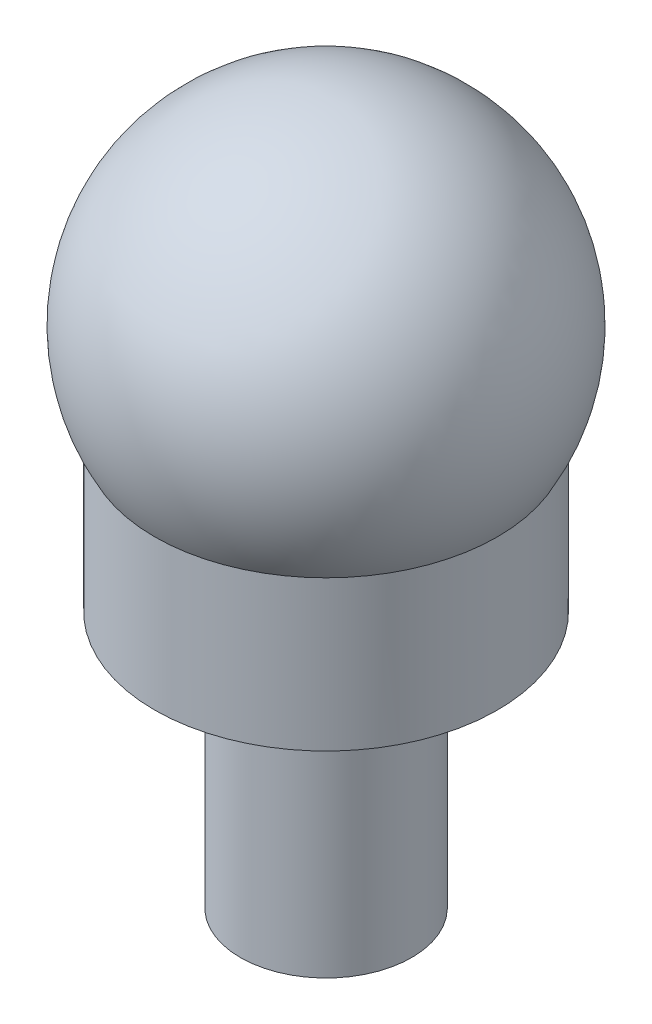
ISO-10303-21;
HEADER;
FILE_DESCRIPTION(('STEP AP214'),'2;1');
FILE_NAME('part.step','',(''),(''),'','','');
FILE_SCHEMA(('AUTOMOTIVE_DESIGN { 1 0 10303 214 1 1 1 1 }'));
ENDSEC;
DATA;
#1=APPLICATION_CONTEXT('core data for automotive mechanical design processes');
#2=APPLICATION_PROTOCOL_DEFINITION('international standard','automotive_design',2000,#1);
#3=PRODUCT_CONTEXT('',#1,'mechanical');
#4=PRODUCT('Part','Part','',(#3));
#5=PRODUCT_RELATED_PRODUCT_CATEGORY('part','',(#4));
#6=PRODUCT_DEFINITION_FORMATION('','',#4);
#7=PRODUCT_DEFINITION_CONTEXT('part definition',#1,'design');
#8=PRODUCT_DEFINITION('design','',#6,#7);
#9=PRODUCT_DEFINITION_SHAPE('','',#8);
#10=(LENGTH_UNIT() NAMED_UNIT(*) SI_UNIT(.MILLI.,.METRE.));
#11=(NAMED_UNIT(*) PLANE_ANGLE_UNIT() SI_UNIT($,.RADIAN.));
#12=(NAMED_UNIT(*) SI_UNIT($,.STERADIAN.) SOLID_ANGLE_UNIT());
#13=UNCERTAINTY_MEASURE_WITH_UNIT(LENGTH_MEASURE(1.E-05),#10,'distance_accuracy_value','');
#14=(GEOMETRIC_REPRESENTATION_CONTEXT(3) GLOBAL_UNCERTAINTY_ASSIGNED_CONTEXT((#13)) GLOBAL_UNIT_ASSIGNED_CONTEXT((#10,
#11,#12)) REPRESENTATION_CONTEXT('',''));
#15=CARTESIAN_POINT('',(0.,0.,0.));
#16=DIRECTION('',(0.,0.,1.));
#17=DIRECTION('',(1.,0.,0.));
#18=AXIS2_PLACEMENT_3D('',#15,#16,#17);
#19=CARTESIAN_POINT('',(0.,12.,0.));
#20=DIRECTION('',(0.,-1.,0.));
#21=DIRECTION('',(0.,0.,-1.));
#22=AXIS2_PLACEMENT_3D('',#19,#20,#21);
#23=CYLINDRICAL_SURFACE('',#22,4.);
#24=CARTESIAN_POINT('',(0.,12.,0.));
#25=DIRECTION('',(0.,1.,0.));
#26=DIRECTION('',(0.,0.,1.));
#27=AXIS2_PLACEMENT_3D('',#24,#25,#26);
#28=CIRCLE('',#27,4.);
#29=CARTESIAN_POINT('',(0.,12.,4.));
#30=VERTEX_POINT('',#29);
#31=EDGE_CURVE('E10',#30,#30,#28,.T.);
#32=ORIENTED_EDGE('',*,*,#31,.F.);
#33=EDGE_LOOP('',(#32));
#34=FACE_BOUND('',#33,.T.);
#35=CARTESIAN_POINT('',(0.,0.,0.));
#36=DIRECTION('',(0.,1.,0.));
#37=DIRECTION('',(0.,0.,1.));
#38=AXIS2_PLACEMENT_3D('',#35,#36,#37);
#39=CIRCLE('',#38,4.);
#40=CARTESIAN_POINT('',(0.,0.,4.));
#41=VERTEX_POINT('',#40);
#42=EDGE_CURVE('E36',#41,#41,#39,.T.);
#43=ORIENTED_EDGE('',*,*,#42,.T.);
#44=EDGE_LOOP('',(#43));
#45=FACE_BOUND('',#44,.T.);
#46=ADVANCED_FACE('F33',(#34,#45),#23,.T.);
#47=CARTESIAN_POINT('',(0.,0.,0.));
#48=DIRECTION('',(0.,1.,0.));
#49=DIRECTION('',(0.,0.,1.));
#50=AXIS2_PLACEMENT_3D('',#47,#48,#49);
#51=PLANE('',#50);
#52=ORIENTED_EDGE('',*,*,#42,.F.);
#53=EDGE_LOOP('',(#52));
#54=FACE_BOUND('',#53,.T.);
#55=ADVANCED_FACE('F57',(#54),#51,.F.);
#56=CARTESIAN_POINT('',(0.,19.,0.));
#57=DIRECTION('',(0.,-1.,0.));
#58=DIRECTION('',(0.,0.,-1.));
#59=AXIS2_PLACEMENT_3D('',#56,#57,#58);
#60=CYLINDRICAL_SURFACE('',#59,8.);
#61=CARTESIAN_POINT('',(0.,19.,0.));
#62=DIRECTION('',(0.,1.,0.));
#63=DIRECTION('',(0.,0.,1.));
#64=AXIS2_PLACEMENT_3D('',#61,#62,#63);
#65=CIRCLE('',#64,8.);
#66=CARTESIAN_POINT('',(0.,19.,8.));
#67=VERTEX_POINT('',#66);
#68=EDGE_CURVE('E43',#67,#67,#65,.T.);
#69=ORIENTED_EDGE('',*,*,#68,.F.);
#70=EDGE_LOOP('',(#69));
#71=FACE_BOUND('',#70,.T.);
#72=CARTESIAN_POINT('',(0.,12.,0.));
#73=DIRECTION('',(0.,1.,0.));
#74=DIRECTION('',(0.,0.,1.));
#75=AXIS2_PLACEMENT_3D('',#72,#73,#74);
#76=CIRCLE('',#75,8.);
#77=CARTESIAN_POINT('',(0.,12.,8.));
#78=VERTEX_POINT('',#77);
#79=EDGE_CURVE('E45',#78,#78,#76,.T.);
#80=ORIENTED_EDGE('',*,*,#79,.T.);
#81=EDGE_LOOP('',(#80));
#82=FACE_BOUND('',#81,.T.);
#83=ADVANCED_FACE('F53',(#71,#82),#60,.T.);
#84=CARTESIAN_POINT('',(0.,12.,0.));
#85=DIRECTION('',(0.,1.,0.));
#86=DIRECTION('',(0.,0.,1.));
#87=AXIS2_PLACEMENT_3D('',#84,#85,#86);
#88=PLANE('',#87);
#89=ORIENTED_EDGE('',*,*,#31,.T.);
#90=EDGE_LOOP('',(#89));
#91=FACE_BOUND('',#90,.T.);
#92=ORIENTED_EDGE('',*,*,#79,.F.);
#93=EDGE_LOOP('',(#92));
#94=FACE_BOUND('',#93,.T.);
#95=ADVANCED_FACE('F56',(#91,#94),#88,.F.);
#96=CARTESIAN_POINT('',(0.,23.5596930851488,0.));
#97=DIRECTION('',(0.,1.,0.));
#98=DIRECTION('',(1.,0.,0.));
#99=AXIS2_PLACEMENT_3D('',#96,#97,#98);
#100=SPHERICAL_SURFACE('',#99,9.20819206091803);
#101=ORIENTED_EDGE('',*,*,#68,.T.);
#102=EDGE_LOOP('',(#101));
#103=FACE_BOUND('',#102,.T.);
#104=ADVANCED_FACE('F51',(#103),#100,.T.);
#105=CLOSED_SHELL('',(#46,#55,#83,#95,#104));
#106=MANIFOLD_SOLID_BREP('B2',#105);
#107=ADVANCED_BREP_SHAPE_REPRESENTATION('',(#18,#106),#14);
#108=SHAPE_DEFINITION_REPRESENTATION(#9,#107);
ENDSEC;
END-ISO-10303-21;
